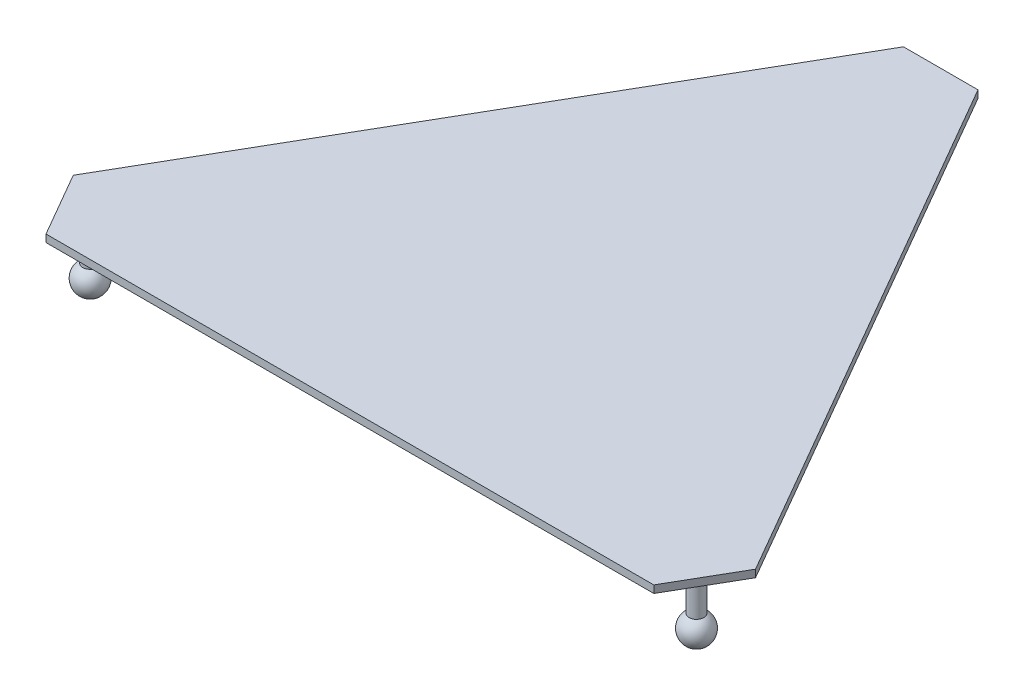
ISO-10303-21;
HEADER;
FILE_DESCRIPTION(('STEP AP214'),'2;1');
FILE_NAME('part.step','',(''),(''),'','','');
FILE_SCHEMA(('AUTOMOTIVE_DESIGN { 1 0 10303 214 1 1 1 1 }'));
ENDSEC;
DATA;
#1=APPLICATION_CONTEXT('core data for automotive mechanical design processes');
#2=APPLICATION_PROTOCOL_DEFINITION('international standard','automotive_design',2000,#1);
#3=PRODUCT_CONTEXT('',#1,'mechanical');
#4=PRODUCT('Part','Part','',(#3));
#5=PRODUCT_RELATED_PRODUCT_CATEGORY('part','',(#4));
#6=PRODUCT_DEFINITION_FORMATION('','',#4);
#7=PRODUCT_DEFINITION_CONTEXT('part definition',#1,'design');
#8=PRODUCT_DEFINITION('design','',#6,#7);
#9=PRODUCT_DEFINITION_SHAPE('','',#8);
#10=(LENGTH_UNIT() NAMED_UNIT(*) SI_UNIT(.MILLI.,.METRE.));
#11=(NAMED_UNIT(*) PLANE_ANGLE_UNIT() SI_UNIT($,.RADIAN.));
#12=(NAMED_UNIT(*) SI_UNIT($,.STERADIAN.) SOLID_ANGLE_UNIT());
#13=UNCERTAINTY_MEASURE_WITH_UNIT(LENGTH_MEASURE(1.E-05),#10,'distance_accuracy_value','');
#14=(GEOMETRIC_REPRESENTATION_CONTEXT(3) GLOBAL_UNCERTAINTY_ASSIGNED_CONTEXT((#13)) GLOBAL_UNIT_ASSIGNED_CONTEXT((#10,
#11,#12)) REPRESENTATION_CONTEXT('',''));
#15=CARTESIAN_POINT('',(0.,0.,0.));
#16=DIRECTION('',(0.,0.,1.));
#17=DIRECTION('',(1.,0.,0.));
#18=AXIS2_PLACEMENT_3D('',#15,#16,#17);
#19=CARTESIAN_POINT('',(458.012701892218,10.,206.69872981078));
#20=DIRECTION('',(-0.86602540378444,0.,0.499999999999998));
#21=DIRECTION('',(0.499999999999998,0.,0.86602540378444));
#22=AXIS2_PLACEMENT_3D('',#19,#20,#21);
#23=PLANE('',#22);
#24=DIRECTION('',(-0.499999999999998,0.,-0.86602540378444));
#25=VECTOR('',#24,1.);
#26=CARTESIAN_POINT('',(458.012701892218,0.,206.69872981078));
#27=LINE('',#26,#25);
#28=CARTESIAN_POINT('',(458.012701892218,0.,206.69872981078));
#29=VERTEX_POINT('',#28);
#30=CARTESIAN_POINT('',(50.,0.,-500.));
#31=VERTEX_POINT('',#30);
#32=EDGE_CURVE('E117',#29,#31,#27,.T.);
#33=ORIENTED_EDGE('',*,*,#32,.T.);
#34=DIRECTION('',(0.,-1.,0.));
#35=VECTOR('',#34,1.);
#36=CARTESIAN_POINT('',(50.,10.,-500.));
#37=LINE('',#36,#35);
#38=CARTESIAN_POINT('',(50.,10.,-500.));
#39=VERTEX_POINT('',#38);
#40=EDGE_CURVE('E11',#39,#31,#37,.T.);
#41=ORIENTED_EDGE('',*,*,#40,.F.);
#42=DIRECTION('',(-0.499999999999998,0.,-0.86602540378444));
#43=VECTOR('',#42,1.);
#44=CARTESIAN_POINT('',(458.012701892218,10.,206.69872981078));
#45=LINE('',#44,#43);
#46=CARTESIAN_POINT('',(458.012701892218,10.,206.69872981078));
#47=VERTEX_POINT('',#46);
#48=EDGE_CURVE('E128',#47,#39,#45,.T.);
#49=ORIENTED_EDGE('',*,*,#48,.F.);
#50=DIRECTION('',(0.,-1.,0.));
#51=VECTOR('',#50,1.);
#52=CARTESIAN_POINT('',(458.012701892218,10.,206.69872981078));
#53=LINE('',#52,#51);
#54=EDGE_CURVE('E113',#47,#29,#53,.T.);
#55=ORIENTED_EDGE('',*,*,#54,.T.);
#56=EDGE_LOOP('',(#33,#41,#49,#55));
#57=FACE_BOUND('',#56,.T.);
#58=ADVANCED_FACE('F33',(#57),#23,.F.);
#59=CARTESIAN_POINT('',(-50.,10.,-500.));
#60=DIRECTION('',(0.,0.,1.));
#61=DIRECTION('',(1.,0.,0.));
#62=AXIS2_PLACEMENT_3D('',#59,#60,#61);
#63=PLANE('',#62);
#64=DIRECTION('',(-1.,0.,0.));
#65=VECTOR('',#64,1.);
#66=CARTESIAN_POINT('',(-50.,0.,-500.));
#67=LINE('',#66,#65);
#68=CARTESIAN_POINT('',(-50.,0.,-500.));
#69=VERTEX_POINT('',#68);
#70=EDGE_CURVE('E120',#31,#69,#67,.T.);
#71=ORIENTED_EDGE('',*,*,#70,.T.);
#72=DIRECTION('',(0.,-1.,0.));
#73=VECTOR('',#72,1.);
#74=CARTESIAN_POINT('',(-50.,10.,-500.));
#75=LINE('',#74,#73);
#76=CARTESIAN_POINT('',(-50.,10.,-500.));
#77=VERTEX_POINT('',#76);
#78=EDGE_CURVE('E41',#77,#69,#75,.T.);
#79=ORIENTED_EDGE('',*,*,#78,.F.);
#80=DIRECTION('',(-1.,0.,0.));
#81=VECTOR('',#80,1.);
#82=CARTESIAN_POINT('',(-50.,10.,-500.));
#83=LINE('',#82,#81);
#84=EDGE_CURVE('E86',#39,#77,#83,.T.);
#85=ORIENTED_EDGE('',*,*,#84,.F.);
#86=ORIENTED_EDGE('',*,*,#40,.T.);
#87=EDGE_LOOP('',(#71,#79,#85,#86));
#88=FACE_BOUND('',#87,.T.);
#89=ADVANCED_FACE('F152',(#88),#63,.F.);
#90=CARTESIAN_POINT('',(-50.,10.,-500.));
#91=DIRECTION('',(0.866025403784436,0.,0.500000000000004));
#92=DIRECTION('',(0.500000000000004,0.,-0.866025403784436));
#93=AXIS2_PLACEMENT_3D('',#90,#91,#92);
#94=PLANE('',#93);
#95=DIRECTION('',(-0.500000000000004,0.,0.866025403784436));
#96=VECTOR('',#95,1.);
#97=CARTESIAN_POINT('',(-50.,0.,-500.));
#98=LINE('',#97,#96);
#99=CARTESIAN_POINT('',(-458.012701892221,0.,206.698729810774));
#100=VERTEX_POINT('',#99);
#101=EDGE_CURVE('E123',#69,#100,#98,.T.);
#102=ORIENTED_EDGE('',*,*,#101,.T.);
#103=DIRECTION('',(0.,-1.,0.));
#104=VECTOR('',#103,1.);
#105=CARTESIAN_POINT('',(-458.012701892221,10.,206.698729810774));
#106=LINE('',#105,#104);
#107=CARTESIAN_POINT('',(-458.012701892221,10.,206.698729810774));
#108=VERTEX_POINT('',#107);
#109=EDGE_CURVE('E108',#108,#100,#106,.T.);
#110=ORIENTED_EDGE('',*,*,#109,.F.);
#111=DIRECTION('',(-0.500000000000004,0.,0.866025403784436));
#112=VECTOR('',#111,1.);
#113=CARTESIAN_POINT('',(-50.,10.,-500.));
#114=LINE('',#113,#112);
#115=EDGE_CURVE('E99',#77,#108,#114,.T.);
#116=ORIENTED_EDGE('',*,*,#115,.F.);
#117=ORIENTED_EDGE('',*,*,#78,.T.);
#118=EDGE_LOOP('',(#102,#110,#116,#117));
#119=FACE_BOUND('',#118,.T.);
#120=ADVANCED_FACE('F134',(#119),#94,.F.);
#121=CARTESIAN_POINT('',(-408.012701892222,10.,293.301270189218));
#122=DIRECTION('',(0.866025403784443,0.,-0.499999999999992));
#123=DIRECTION('',(-0.499999999999992,0.,-0.866025403784443));
#124=AXIS2_PLACEMENT_3D('',#121,#122,#123);
#125=PLANE('',#124);
#126=DIRECTION('',(0.499999999999992,0.,0.866025403784443));
#127=VECTOR('',#126,1.);
#128=CARTESIAN_POINT('',(-408.012701892222,0.,293.301270189218));
#129=LINE('',#128,#127);
#130=CARTESIAN_POINT('',(-408.012701892222,0.,293.301270189218));
#131=VERTEX_POINT('',#130);
#132=EDGE_CURVE('E107',#100,#131,#129,.T.);
#133=ORIENTED_EDGE('',*,*,#132,.T.);
#134=DIRECTION('',(0.,-1.,0.));
#135=VECTOR('',#134,1.);
#136=CARTESIAN_POINT('',(-408.012701892222,10.,293.301270189218));
#137=LINE('',#136,#135);
#138=CARTESIAN_POINT('',(-408.012701892222,10.,293.301270189218));
#139=VERTEX_POINT('',#138);
#140=EDGE_CURVE('E104',#139,#131,#137,.T.);
#141=ORIENTED_EDGE('',*,*,#140,.F.);
#142=DIRECTION('',(0.499999999999992,0.,0.866025403784443));
#143=VECTOR('',#142,1.);
#144=CARTESIAN_POINT('',(-408.012701892222,10.,293.301270189218));
#145=LINE('',#144,#143);
#146=EDGE_CURVE('E93',#108,#139,#145,.T.);
#147=ORIENTED_EDGE('',*,*,#146,.F.);
#148=ORIENTED_EDGE('',*,*,#109,.T.);
#149=EDGE_LOOP('',(#133,#141,#147,#148));
#150=FACE_BOUND('',#149,.T.);
#151=ADVANCED_FACE('F105',(#150),#125,.F.);
#152=CARTESIAN_POINT('',(408.012701892218,10.,293.301270189224));
#153=DIRECTION('',(0.,0.,-1.));
#154=DIRECTION('',(-1.,0.,0.));
#155=AXIS2_PLACEMENT_3D('',#152,#153,#154);
#156=PLANE('',#155);
#157=DIRECTION('',(1.,0.,0.));
#158=VECTOR('',#157,1.);
#159=CARTESIAN_POINT('',(408.012701892218,0.,293.301270189224));
#160=LINE('',#159,#158);
#161=CARTESIAN_POINT('',(408.012701892218,0.,293.301270189224));
#162=VERTEX_POINT('',#161);
#163=EDGE_CURVE('E72',#131,#162,#160,.T.);
#164=ORIENTED_EDGE('',*,*,#163,.T.);
#165=DIRECTION('',(0.,-1.,0.));
#166=VECTOR('',#165,1.);
#167=CARTESIAN_POINT('',(408.012701892218,10.,293.301270189224));
#168=LINE('',#167,#166);
#169=CARTESIAN_POINT('',(408.012701892218,10.,293.301270189224));
#170=VERTEX_POINT('',#169);
#171=EDGE_CURVE('E109',#170,#162,#168,.T.);
#172=ORIENTED_EDGE('',*,*,#171,.F.);
#173=DIRECTION('',(1.,0.,0.));
#174=VECTOR('',#173,1.);
#175=CARTESIAN_POINT('',(408.012701892218,10.,293.301270189224));
#176=LINE('',#175,#174);
#177=EDGE_CURVE('E97',#139,#170,#176,.T.);
#178=ORIENTED_EDGE('',*,*,#177,.F.);
#179=ORIENTED_EDGE('',*,*,#140,.T.);
#180=EDGE_LOOP('',(#164,#172,#178,#179));
#181=FACE_BOUND('',#180,.T.);
#182=ADVANCED_FACE('F111',(#181),#156,.F.);
#183=CARTESIAN_POINT('',(458.012701892218,10.,206.69872981078));
#184=DIRECTION('',(-0.866025403784436,0.,-0.500000000000004));
#185=DIRECTION('',(-0.500000000000004,0.,0.866025403784436));
#186=AXIS2_PLACEMENT_3D('',#183,#184,#185);
#187=PLANE('',#186);
#188=DIRECTION('',(0.500000000000004,0.,-0.866025403784436));
#189=VECTOR('',#188,1.);
#190=CARTESIAN_POINT('',(458.012701892218,0.,206.69872981078));
#191=LINE('',#190,#189);
#192=EDGE_CURVE('E78',#162,#29,#191,.T.);
#193=ORIENTED_EDGE('',*,*,#192,.T.);
#194=ORIENTED_EDGE('',*,*,#54,.F.);
#195=DIRECTION('',(0.500000000000004,0.,-0.866025403784436));
#196=VECTOR('',#195,1.);
#197=CARTESIAN_POINT('',(458.012701892218,10.,206.69872981078));
#198=LINE('',#197,#196);
#199=EDGE_CURVE('E49',#170,#47,#198,.T.);
#200=ORIENTED_EDGE('',*,*,#199,.F.);
#201=ORIENTED_EDGE('',*,*,#171,.T.);
#202=EDGE_LOOP('',(#193,#194,#200,#201));
#203=FACE_BOUND('',#202,.T.);
#204=ADVANCED_FACE('F141',(#203),#187,.F.);
#205=CARTESIAN_POINT('',(0.,10.,0.));
#206=DIRECTION('',(0.,-1.,0.));
#207=DIRECTION('',(0.,0.,-1.));
#208=AXIS2_PLACEMENT_3D('',#205,#206,#207);
#209=PLANE('',#208);
#210=ORIENTED_EDGE('',*,*,#48,.T.);
#211=ORIENTED_EDGE('',*,*,#84,.T.);
#212=ORIENTED_EDGE('',*,*,#115,.T.);
#213=ORIENTED_EDGE('',*,*,#146,.T.);
#214=ORIENTED_EDGE('',*,*,#177,.T.);
#215=ORIENTED_EDGE('',*,*,#199,.T.);
#216=EDGE_LOOP('',(#210,#211,#212,#213,#214,#215));
#217=FACE_BOUND('',#216,.T.);
#218=ADVANCED_FACE('F95',(#217),#209,.F.);
#219=CARTESIAN_POINT('',(0.,0.,0.));
#220=DIRECTION('',(0.,-1.,0.));
#221=DIRECTION('',(0.,0.,-1.));
#222=AXIS2_PLACEMENT_3D('',#219,#220,#221);
#223=PLANE('',#222);
#224=CARTESIAN_POINT('',(407.031939778688,-2.4614943438844E-12,234.999999999996));
#225=DIRECTION('',(0.,1.,0.));
#226=DIRECTION('',(-0.866025403784443,0.,-0.499999999999992));
#227=AXIS2_PLACEMENT_3D('',#224,#225,#226);
#228=CIRCLE('',#227,10.);
#229=CARTESIAN_POINT('',(398.371685740844,-2.40912212380175E-12,229.999999999996));
#230=VERTEX_POINT('',#229);
#231=EDGE_CURVE('E255',#230,#230,#228,.T.);
#232=ORIENTED_EDGE('',*,*,#231,.T.);
#233=EDGE_LOOP('',(#232));
#234=FACE_BOUND('',#233,.T.);
#235=CARTESIAN_POINT('',(-407.031939778685,-2.46149434388442E-12,235.000000000002));
#236=DIRECTION('',(0.,1.,0.));
#237=DIRECTION('',(0.866025403784436,0.,-0.500000000000004));
#238=AXIS2_PLACEMENT_3D('',#235,#236,#237);
#239=CIRCLE('',#238,10.);
#240=CARTESIAN_POINT('',(-398.371685740841,-2.40912212380177E-12,230.000000000002));
#241=VERTEX_POINT('',#240);
#242=EDGE_CURVE('E259',#241,#241,#239,.T.);
#243=ORIENTED_EDGE('',*,*,#242,.T.);
#244=EDGE_LOOP('',(#243));
#245=FACE_BOUND('',#244,.T.);
#246=CARTESIAN_POINT('',(0.,0.,-470.));
#247=DIRECTION('',(0.,1.,0.));
#248=DIRECTION('',(0.,0.,1.));
#249=AXIS2_PLACEMENT_3D('',#246,#247,#248);
#250=CIRCLE('',#249,10.);
#251=CARTESIAN_POINT('',(0.,0.,-460.));
#252=VERTEX_POINT('',#251);
#253=EDGE_CURVE('E268',#252,#252,#250,.T.);
#254=ORIENTED_EDGE('',*,*,#253,.T.);
#255=EDGE_LOOP('',(#254));
#256=FACE_BOUND('',#255,.T.);
#257=ORIENTED_EDGE('',*,*,#32,.F.);
#258=ORIENTED_EDGE('',*,*,#192,.F.);
#259=ORIENTED_EDGE('',*,*,#163,.F.);
#260=ORIENTED_EDGE('',*,*,#132,.F.);
#261=ORIENTED_EDGE('',*,*,#101,.F.);
#262=ORIENTED_EDGE('',*,*,#70,.F.);
#263=EDGE_LOOP('',(#257,#258,#259,#260,#261,#262));
#264=FACE_BOUND('',#263,.T.);
#265=ADVANCED_FACE('F137',(#234,#245,#256,#264),#223,.T.);
#266=CARTESIAN_POINT('',(0.,-70.,-470.));
#267=DIRECTION('',(0.,1.,0.));
#268=DIRECTION('',(0.,0.,-1.));
#269=AXIS2_PLACEMENT_3D('',#266,#267,#268);
#270=SPHERICAL_SURFACE('',#269,20.);
#271=CARTESIAN_POINT('',(0.,-52.6794919243112,-470.));
#272=DIRECTION('',(0.,1.,0.));
#273=DIRECTION('',(0.,0.,1.));
#274=AXIS2_PLACEMENT_3D('',#271,#272,#273);
#275=CIRCLE('',#274,10.);
#276=CARTESIAN_POINT('',(0.,-52.6794919243112,-460.));
#277=VERTEX_POINT('',#276);
#278=EDGE_CURVE('E121',#277,#277,#275,.T.);
#279=ORIENTED_EDGE('',*,*,#278,.F.);
#280=EDGE_LOOP('',(#279));
#281=FACE_BOUND('',#280,.T.);
#282=ADVANCED_FACE('F187',(#281),#270,.T.);
#283=CARTESIAN_POINT('',(0.,0.,-470.));
#284=DIRECTION('',(0.,1.,0.));
#285=DIRECTION('',(0.,0.,1.));
#286=AXIS2_PLACEMENT_3D('',#283,#284,#285);
#287=CYLINDRICAL_SURFACE('',#286,10.);
#288=ORIENTED_EDGE('',*,*,#253,.F.);
#289=EDGE_LOOP('',(#288));
#290=FACE_BOUND('',#289,.T.);
#291=ORIENTED_EDGE('',*,*,#278,.T.);
#292=EDGE_LOOP('',(#291));
#293=FACE_BOUND('',#292,.T.);
#294=ADVANCED_FACE('F192',(#290,#293),#287,.T.);
#295=CARTESIAN_POINT('',(-407.031939778685,-70.0000000000025,235.000000000002));
#296=DIRECTION('',(0.,1.,0.));
#297=DIRECTION('',(-0.866025403784436,0.,0.500000000000004));
#298=AXIS2_PLACEMENT_3D('',#295,#296,#297);
#299=SPHERICAL_SURFACE('',#298,20.);
#300=CARTESIAN_POINT('',(-407.031939778685,-52.6794919243137,235.000000000002));
#301=DIRECTION('',(0.,1.,0.));
#302=DIRECTION('',(0.866025403784436,0.,-0.500000000000004));
#303=AXIS2_PLACEMENT_3D('',#300,#301,#302);
#304=CIRCLE('',#303,10.);
#305=CARTESIAN_POINT('',(-398.371685740841,-52.6794919243136,230.000000000002));
#306=VERTEX_POINT('',#305);
#307=EDGE_CURVE('E262',#306,#306,#304,.T.);
#308=ORIENTED_EDGE('',*,*,#307,.F.);
#309=EDGE_LOOP('',(#308));
#310=FACE_BOUND('',#309,.T.);
#311=ADVANCED_FACE('F202',(#310),#299,.T.);
#312=CARTESIAN_POINT('',(-407.031939778685,-2.46149434388442E-12,235.000000000002));
#313=DIRECTION('',(0.,1.,0.));
#314=DIRECTION('',(0.866025403784436,0.,-0.500000000000004));
#315=AXIS2_PLACEMENT_3D('',#312,#313,#314);
#316=CYLINDRICAL_SURFACE('',#315,10.);
#317=ORIENTED_EDGE('',*,*,#242,.F.);
#318=EDGE_LOOP('',(#317));
#319=FACE_BOUND('',#318,.T.);
#320=ORIENTED_EDGE('',*,*,#307,.T.);
#321=EDGE_LOOP('',(#320));
#322=FACE_BOUND('',#321,.T.);
#323=ADVANCED_FACE('F218',(#319,#322),#316,.T.);
#324=CARTESIAN_POINT('',(407.031939778688,-70.0000000000025,234.999999999996));
#325=DIRECTION('',(0.,1.,0.));
#326=DIRECTION('',(0.866025403784443,0.,0.499999999999992));
#327=AXIS2_PLACEMENT_3D('',#324,#325,#326);
#328=SPHERICAL_SURFACE('',#327,20.);
#329=CARTESIAN_POINT('',(407.031939778688,-52.6794919243137,234.999999999996));
#330=DIRECTION('',(0.,1.,0.));
#331=DIRECTION('',(-0.866025403784443,0.,-0.499999999999992));
#332=AXIS2_PLACEMENT_3D('',#329,#330,#331);
#333=CIRCLE('',#332,10.);
#334=CARTESIAN_POINT('',(398.371685740844,-52.6794919243136,229.999999999996));
#335=VERTEX_POINT('',#334);
#336=EDGE_CURVE('E258',#335,#335,#333,.T.);
#337=ORIENTED_EDGE('',*,*,#336,.F.);
#338=EDGE_LOOP('',(#337));
#339=FACE_BOUND('',#338,.T.);
#340=ADVANCED_FACE('F228',(#339),#328,.T.);
#341=CARTESIAN_POINT('',(407.031939778688,-2.4614943438844E-12,234.999999999996));
#342=DIRECTION('',(0.,1.,0.));
#343=DIRECTION('',(-0.866025403784443,0.,-0.499999999999992));
#344=AXIS2_PLACEMENT_3D('',#341,#342,#343);
#345=CYLINDRICAL_SURFACE('',#344,10.);
#346=ORIENTED_EDGE('',*,*,#231,.F.);
#347=EDGE_LOOP('',(#346));
#348=FACE_BOUND('',#347,.T.);
#349=ORIENTED_EDGE('',*,*,#336,.T.);
#350=EDGE_LOOP('',(#349));
#351=FACE_BOUND('',#350,.T.);
#352=ADVANCED_FACE('F238',(#348,#351),#345,.T.);
#353=CLOSED_SHELL('',(#58,#89,#120,#151,#182,#204,#218,#265,#282,#294,#311,#323,#340,#352));
#354=MANIFOLD_SOLID_BREP('B2',#353);
#355=ADVANCED_BREP_SHAPE_REPRESENTATION('',(#18,#354),#14);
#356=SHAPE_DEFINITION_REPRESENTATION(#9,#355);
ENDSEC;
END-ISO-10303-21;
